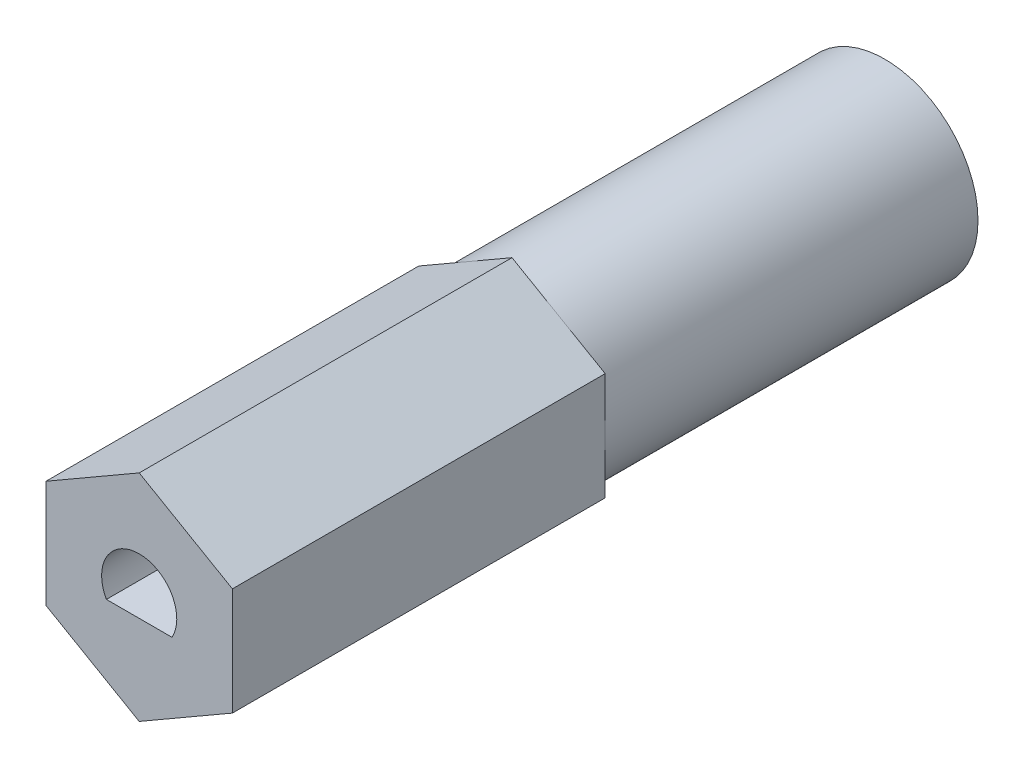
ISO-10303-21;
HEADER;
FILE_DESCRIPTION(('STEP AP214'),'2;1');
FILE_NAME('part.step','',(''),(''),'','','');
FILE_SCHEMA(('AUTOMOTIVE_DESIGN { 1 0 10303 214 1 1 1 1 }'));
ENDSEC;
DATA;
#1=APPLICATION_CONTEXT('core data for automotive mechanical design processes');
#2=APPLICATION_PROTOCOL_DEFINITION('international standard','automotive_design',2000,#1);
#3=PRODUCT_CONTEXT('',#1,'mechanical');
#4=PRODUCT('Part','Part','',(#3));
#5=PRODUCT_RELATED_PRODUCT_CATEGORY('part','',(#4));
#6=PRODUCT_DEFINITION_FORMATION('','',#4);
#7=PRODUCT_DEFINITION_CONTEXT('part definition',#1,'design');
#8=PRODUCT_DEFINITION('design','',#6,#7);
#9=PRODUCT_DEFINITION_SHAPE('','',#8);
#10=(LENGTH_UNIT() NAMED_UNIT(*) SI_UNIT(.MILLI.,.METRE.));
#11=(NAMED_UNIT(*) PLANE_ANGLE_UNIT() SI_UNIT($,.RADIAN.));
#12=(NAMED_UNIT(*) SI_UNIT($,.STERADIAN.) SOLID_ANGLE_UNIT());
#13=UNCERTAINTY_MEASURE_WITH_UNIT(LENGTH_MEASURE(1.E-05),#10,'distance_accuracy_value','');
#14=(GEOMETRIC_REPRESENTATION_CONTEXT(3) GLOBAL_UNCERTAINTY_ASSIGNED_CONTEXT((#13)) GLOBAL_UNIT_ASSIGNED_CONTEXT((#10,
#11,#12)) REPRESENTATION_CONTEXT('',''));
#15=CARTESIAN_POINT('',(0.,0.,0.));
#16=DIRECTION('',(0.,0.,1.));
#17=DIRECTION('',(1.,0.,0.));
#18=AXIS2_PLACEMENT_3D('',#15,#16,#17);
#19=CARTESIAN_POINT('',(3.175,1.83308710467706,-25.4));
#20=DIRECTION('',(0.5,0.866025403784439,0.));
#21=DIRECTION('',(-0.866025403784439,0.5,0.));
#22=AXIS2_PLACEMENT_3D('',#19,#20,#21);
#23=PLANE('',#22);
#24=DIRECTION('',(0.866025403784439,-0.5,0.));
#25=VECTOR('',#24,1.);
#26=CARTESIAN_POINT('',(3.175,1.83308710467706,-12.7));
#27=LINE('',#26,#25);
#28=CARTESIAN_POINT('',(0.,3.66617420935412,-12.7));
#29=VERTEX_POINT('',#28);
#30=CARTESIAN_POINT('',(1.5875,2.74963065701559,-12.7));
#31=VERTEX_POINT('',#30);
#32=EDGE_CURVE('E153',#29,#31,#27,.T.);
#33=ORIENTED_EDGE('',*,*,#32,.F.);
#34=DIRECTION('',(0.,0.,1.));
#35=VECTOR('',#34,1.);
#36=CARTESIAN_POINT('',(0.,3.66617420935412,-25.4));
#37=LINE('',#36,#35);
#38=CARTESIAN_POINT('',(0.,3.66617420935412,0.));
#39=VERTEX_POINT('',#38);
#40=EDGE_CURVE('E186',#29,#39,#37,.T.);
#41=ORIENTED_EDGE('',*,*,#40,.T.);
#42=DIRECTION('',(-0.866025403784439,0.5,0.));
#43=VECTOR('',#42,1.);
#44=CARTESIAN_POINT('',(3.175,1.83308710467706,0.));
#45=LINE('',#44,#43);
#46=CARTESIAN_POINT('',(3.175,1.83308710467706,0.));
#47=VERTEX_POINT('',#46);
#48=EDGE_CURVE('E167',#47,#39,#45,.T.);
#49=ORIENTED_EDGE('',*,*,#48,.F.);
#50=DIRECTION('',(0.,0.,1.));
#51=VECTOR('',#50,1.);
#52=CARTESIAN_POINT('',(3.175,1.83308710467706,-25.4));
#53=LINE('',#52,#51);
#54=CARTESIAN_POINT('',(3.175,1.83308710467706,-12.7));
#55=VERTEX_POINT('',#54);
#56=EDGE_CURVE('E187',#55,#47,#53,.T.);
#57=ORIENTED_EDGE('',*,*,#56,.F.);
#58=EDGE_CURVE('E124',#31,#55,#27,.T.);
#59=ORIENTED_EDGE('',*,*,#58,.F.);
#60=EDGE_LOOP('',(#33,#41,#49,#57,#59));
#61=FACE_BOUND('',#60,.T.);
#62=ADVANCED_FACE('F36',(#61),#23,.T.);
#63=CARTESIAN_POINT('',(3.175,-1.83308710467706,-25.4));
#64=DIRECTION('',(1.,0.,0.));
#65=DIRECTION('',(0.,1.,0.));
#66=AXIS2_PLACEMENT_3D('',#63,#64,#65);
#67=PLANE('',#66);
#68=DIRECTION('',(0.,-1.,0.));
#69=VECTOR('',#68,1.);
#70=CARTESIAN_POINT('',(3.175,-1.83308710467706,-12.7));
#71=LINE('',#70,#69);
#72=CARTESIAN_POINT('',(3.175,0.,-12.7));
#73=VERTEX_POINT('',#72);
#74=EDGE_CURVE('E118',#55,#73,#71,.T.);
#75=ORIENTED_EDGE('',*,*,#74,.F.);
#76=ORIENTED_EDGE('',*,*,#56,.T.);
#77=DIRECTION('',(0.,1.,0.));
#78=VECTOR('',#77,1.);
#79=CARTESIAN_POINT('',(3.175,-1.83308710467706,0.));
#80=LINE('',#79,#78);
#81=CARTESIAN_POINT('',(3.175,-1.83308710467706,0.));
#82=VERTEX_POINT('',#81);
#83=EDGE_CURVE('E183',#82,#47,#80,.T.);
#84=ORIENTED_EDGE('',*,*,#83,.F.);
#85=DIRECTION('',(0.,0.,1.));
#86=VECTOR('',#85,1.);
#87=CARTESIAN_POINT('',(3.175,-1.83308710467706,-25.4));
#88=LINE('',#87,#86);
#89=CARTESIAN_POINT('',(3.175,-1.83308710467706,-12.7));
#90=VERTEX_POINT('',#89);
#91=EDGE_CURVE('E147',#90,#82,#88,.T.);
#92=ORIENTED_EDGE('',*,*,#91,.F.);
#93=EDGE_CURVE('E128',#73,#90,#71,.T.);
#94=ORIENTED_EDGE('',*,*,#93,.F.);
#95=EDGE_LOOP('',(#75,#76,#84,#92,#94));
#96=FACE_BOUND('',#95,.T.);
#97=ADVANCED_FACE('F145',(#96),#67,.T.);
#98=CARTESIAN_POINT('',(0.,-3.66617420935412,-25.4));
#99=DIRECTION('',(0.5,-0.866025403784438,0.));
#100=DIRECTION('',(0.866025403784439,0.5,0.));
#101=AXIS2_PLACEMENT_3D('',#98,#99,#100);
#102=PLANE('',#101);
#103=DIRECTION('',(-0.866025403784439,-0.5,0.));
#104=VECTOR('',#103,1.);
#105=CARTESIAN_POINT('',(0.,-3.66617420935412,-12.7));
#106=LINE('',#105,#104);
#107=CARTESIAN_POINT('',(1.5875,-2.74963065701559,-12.7));
#108=VERTEX_POINT('',#107);
#109=EDGE_CURVE('E135',#90,#108,#106,.T.);
#110=ORIENTED_EDGE('',*,*,#109,.F.);
#111=ORIENTED_EDGE('',*,*,#91,.T.);
#112=DIRECTION('',(0.866025403784439,0.5,0.));
#113=VECTOR('',#112,1.);
#114=CARTESIAN_POINT('',(0.,-3.66617420935412,0.));
#115=LINE('',#114,#113);
#116=CARTESIAN_POINT('',(0.,-3.66617420935412,0.));
#117=VERTEX_POINT('',#116);
#118=EDGE_CURVE('E180',#117,#82,#115,.T.);
#119=ORIENTED_EDGE('',*,*,#118,.F.);
#120=DIRECTION('',(0.,0.,1.));
#121=VECTOR('',#120,1.);
#122=CARTESIAN_POINT('',(0.,-3.66617420935412,-25.4));
#123=LINE('',#122,#121);
#124=CARTESIAN_POINT('',(0.,-3.66617420935412,-12.7));
#125=VERTEX_POINT('',#124);
#126=EDGE_CURVE('E191',#125,#117,#123,.T.);
#127=ORIENTED_EDGE('',*,*,#126,.F.);
#128=EDGE_CURVE('E148',#108,#125,#106,.T.);
#129=ORIENTED_EDGE('',*,*,#128,.F.);
#130=EDGE_LOOP('',(#110,#111,#119,#127,#129));
#131=FACE_BOUND('',#130,.T.);
#132=ADVANCED_FACE('F217',(#131),#102,.T.);
#133=CARTESIAN_POINT('',(-3.175,-1.83308710467706,-25.4));
#134=DIRECTION('',(-0.5,-0.866025403784439,0.));
#135=DIRECTION('',(0.866025403784439,-0.5,0.));
#136=AXIS2_PLACEMENT_3D('',#133,#134,#135);
#137=PLANE('',#136);
#138=DIRECTION('',(-0.866025403784439,0.5,0.));
#139=VECTOR('',#138,1.);
#140=CARTESIAN_POINT('',(-3.175,-1.83308710467706,-12.7));
#141=LINE('',#140,#139);
#142=CARTESIAN_POINT('',(-1.5875,-2.74963065701559,-12.7));
#143=VERTEX_POINT('',#142);
#144=EDGE_CURVE('E221',#125,#143,#141,.T.);
#145=ORIENTED_EDGE('',*,*,#144,.F.);
#146=ORIENTED_EDGE('',*,*,#126,.T.);
#147=DIRECTION('',(0.866025403784439,-0.5,0.));
#148=VECTOR('',#147,1.);
#149=CARTESIAN_POINT('',(-3.175,-1.83308710467706,0.));
#150=LINE('',#149,#148);
#151=CARTESIAN_POINT('',(-3.175,-1.83308710467706,0.));
#152=VERTEX_POINT('',#151);
#153=EDGE_CURVE('E177',#152,#117,#150,.T.);
#154=ORIENTED_EDGE('',*,*,#153,.F.);
#155=DIRECTION('',(0.,0.,1.));
#156=VECTOR('',#155,1.);
#157=CARTESIAN_POINT('',(-3.175,-1.83308710467706,-25.4));
#158=LINE('',#157,#156);
#159=CARTESIAN_POINT('',(-3.175,-1.83308710467706,-12.7));
#160=VERTEX_POINT('',#159);
#161=EDGE_CURVE('E193',#160,#152,#158,.T.);
#162=ORIENTED_EDGE('',*,*,#161,.F.);
#163=EDGE_CURVE('E222',#143,#160,#141,.T.);
#164=ORIENTED_EDGE('',*,*,#163,.F.);
#165=EDGE_LOOP('',(#145,#146,#154,#162,#164));
#166=FACE_BOUND('',#165,.T.);
#167=ADVANCED_FACE('F241',(#166),#137,.T.);
#168=CARTESIAN_POINT('',(-3.175,1.83308710467706,-25.4));
#169=DIRECTION('',(-1.,0.,0.));
#170=DIRECTION('',(0.,-1.,0.));
#171=AXIS2_PLACEMENT_3D('',#168,#169,#170);
#172=PLANE('',#171);
#173=DIRECTION('',(0.,1.,0.));
#174=VECTOR('',#173,1.);
#175=CARTESIAN_POINT('',(-3.175,1.83308710467706,-12.7));
#176=LINE('',#175,#174);
#177=CARTESIAN_POINT('',(-3.175,0.,-12.7));
#178=VERTEX_POINT('',#177);
#179=EDGE_CURVE('E223',#160,#178,#176,.T.);
#180=ORIENTED_EDGE('',*,*,#179,.F.);
#181=ORIENTED_EDGE('',*,*,#161,.T.);
#182=DIRECTION('',(0.,-1.,0.));
#183=VECTOR('',#182,1.);
#184=CARTESIAN_POINT('',(-3.175,1.83308710467706,0.));
#185=LINE('',#184,#183);
#186=CARTESIAN_POINT('',(-3.175,1.83308710467706,0.));
#187=VERTEX_POINT('',#186);
#188=EDGE_CURVE('E174',#187,#152,#185,.T.);
#189=ORIENTED_EDGE('',*,*,#188,.F.);
#190=DIRECTION('',(0.,0.,1.));
#191=VECTOR('',#190,1.);
#192=CARTESIAN_POINT('',(-3.175,1.83308710467706,-25.4));
#193=LINE('',#192,#191);
#194=CARTESIAN_POINT('',(-3.175,1.83308710467706,-12.7));
#195=VERTEX_POINT('',#194);
#196=EDGE_CURVE('E195',#195,#187,#193,.T.);
#197=ORIENTED_EDGE('',*,*,#196,.F.);
#198=EDGE_CURVE('E143',#178,#195,#176,.T.);
#199=ORIENTED_EDGE('',*,*,#198,.F.);
#200=EDGE_LOOP('',(#180,#181,#189,#197,#199));
#201=FACE_BOUND('',#200,.T.);
#202=ADVANCED_FACE('F239',(#201),#172,.T.);
#203=CARTESIAN_POINT('',(0.,3.66617420935412,-25.4));
#204=DIRECTION('',(-0.5,0.866025403784439,0.));
#205=DIRECTION('',(-0.866025403784439,-0.5,0.));
#206=AXIS2_PLACEMENT_3D('',#203,#204,#205);
#207=PLANE('',#206);
#208=DIRECTION('',(0.866025403784439,0.5,0.));
#209=VECTOR('',#208,1.);
#210=CARTESIAN_POINT('',(0.,3.66617420935412,-12.7));
#211=LINE('',#210,#209);
#212=CARTESIAN_POINT('',(-1.5875,2.74963065701559,-12.7));
#213=VERTEX_POINT('',#212);
#214=EDGE_CURVE('E12',#195,#213,#211,.T.);
#215=ORIENTED_EDGE('',*,*,#214,.F.);
#216=ORIENTED_EDGE('',*,*,#196,.T.);
#217=DIRECTION('',(-0.866025403784439,-0.5,0.));
#218=VECTOR('',#217,1.);
#219=CARTESIAN_POINT('',(0.,3.66617420935412,0.));
#220=LINE('',#219,#218);
#221=EDGE_CURVE('E171',#39,#187,#220,.T.);
#222=ORIENTED_EDGE('',*,*,#221,.F.);
#223=ORIENTED_EDGE('',*,*,#40,.F.);
#224=EDGE_CURVE('E39',#213,#29,#211,.T.);
#225=ORIENTED_EDGE('',*,*,#224,.F.);
#226=EDGE_LOOP('',(#215,#216,#222,#223,#225));
#227=FACE_BOUND('',#226,.T.);
#228=ADVANCED_FACE('F208',(#227),#207,.T.);
#229=CARTESIAN_POINT('',(0.,0.,0.));
#230=DIRECTION('',(0.,0.,1.));
#231=DIRECTION('',(1.,0.,0.));
#232=AXIS2_PLACEMENT_3D('',#229,#230,#231);
#233=PLANE('',#232);
#234=CARTESIAN_POINT('',(0.,0.,0.));
#235=DIRECTION('',(0.,0.,1.));
#236=DIRECTION('',(1.,0.,0.));
#237=AXIS2_PLACEMENT_3D('',#234,#235,#236);
#238=CIRCLE('',#237,1.28016);
#239=CARTESIAN_POINT('',(1.11731132635448,-0.62484,0.));
#240=VERTEX_POINT('',#239);
#241=CARTESIAN_POINT('',(-1.11731132635448,-0.62484,0.));
#242=VERTEX_POINT('',#241);
#243=EDGE_CURVE('E58',#240,#242,#238,.T.);
#244=ORIENTED_EDGE('',*,*,#243,.F.);
#245=DIRECTION('',(1.,0.,0.));
#246=VECTOR('',#245,1.);
#247=CARTESIAN_POINT('',(-1.11731132635448,-0.62484,0.));
#248=LINE('',#247,#246);
#249=EDGE_CURVE('E158',#242,#240,#248,.T.);
#250=ORIENTED_EDGE('',*,*,#249,.F.);
#251=EDGE_LOOP('',(#244,#250));
#252=FACE_BOUND('',#251,.T.);
#253=ORIENTED_EDGE('',*,*,#48,.T.);
#254=ORIENTED_EDGE('',*,*,#221,.T.);
#255=ORIENTED_EDGE('',*,*,#188,.T.);
#256=ORIENTED_EDGE('',*,*,#153,.T.);
#257=ORIENTED_EDGE('',*,*,#118,.T.);
#258=ORIENTED_EDGE('',*,*,#83,.T.);
#259=EDGE_LOOP('',(#253,#254,#255,#256,#257,#258));
#260=FACE_BOUND('',#259,.T.);
#261=ADVANCED_FACE('F212',(#252,#260),#233,.T.);
#262=CARTESIAN_POINT('',(0.,0.,-5.08));
#263=DIRECTION('',(0.,0.,1.));
#264=DIRECTION('',(1.,0.,0.));
#265=AXIS2_PLACEMENT_3D('',#262,#263,#264);
#266=CYLINDRICAL_SURFACE('',#265,1.28016);
#267=ORIENTED_EDGE('',*,*,#243,.T.);
#268=DIRECTION('',(0.,0.,1.));
#269=VECTOR('',#268,1.);
#270=CARTESIAN_POINT('',(-1.11731132635448,-0.62484,-5.08));
#271=LINE('',#270,#269);
#272=CARTESIAN_POINT('',(-1.11731132635448,-0.62484,-5.08));
#273=VERTEX_POINT('',#272);
#274=EDGE_CURVE('E161',#273,#242,#271,.T.);
#275=ORIENTED_EDGE('',*,*,#274,.F.);
#276=CARTESIAN_POINT('',(0.,0.,-5.08));
#277=DIRECTION('',(0.,0.,1.));
#278=DIRECTION('',(1.,0.,0.));
#279=AXIS2_PLACEMENT_3D('',#276,#277,#278);
#280=CIRCLE('',#279,1.28016);
#281=CARTESIAN_POINT('',(1.11731132635448,-0.62484,-5.08));
#282=VERTEX_POINT('',#281);
#283=EDGE_CURVE('E154',#282,#273,#280,.T.);
#284=ORIENTED_EDGE('',*,*,#283,.F.);
#285=DIRECTION('',(0.,0.,1.));
#286=VECTOR('',#285,1.);
#287=CARTESIAN_POINT('',(1.11731132635448,-0.62484,-5.08));
#288=LINE('',#287,#286);
#289=EDGE_CURVE('E165',#282,#240,#288,.T.);
#290=ORIENTED_EDGE('',*,*,#289,.T.);
#291=EDGE_LOOP('',(#267,#275,#284,#290));
#292=FACE_BOUND('',#291,.T.);
#293=ADVANCED_FACE('F260',(#292),#266,.F.);
#294=CARTESIAN_POINT('',(-1.11731132635448,-0.62484,-5.08));
#295=DIRECTION('',(0.,-1.,0.));
#296=DIRECTION('',(0.,0.,-1.));
#297=AXIS2_PLACEMENT_3D('',#294,#295,#296);
#298=PLANE('',#297);
#299=ORIENTED_EDGE('',*,*,#249,.T.);
#300=ORIENTED_EDGE('',*,*,#289,.F.);
#301=DIRECTION('',(1.,0.,0.));
#302=VECTOR('',#301,1.);
#303=CARTESIAN_POINT('',(-1.11731132635448,-0.62484,-5.08));
#304=LINE('',#303,#302);
#305=EDGE_CURVE('E157',#273,#282,#304,.T.);
#306=ORIENTED_EDGE('',*,*,#305,.F.);
#307=ORIENTED_EDGE('',*,*,#274,.T.);
#308=EDGE_LOOP('',(#299,#300,#306,#307));
#309=FACE_BOUND('',#308,.T.);
#310=ADVANCED_FACE('F268',(#309),#298,.F.);
#311=CARTESIAN_POINT('',(0.,0.,-5.08));
#312=DIRECTION('',(0.,0.,1.));
#313=DIRECTION('',(1.,0.,0.));
#314=AXIS2_PLACEMENT_3D('',#311,#312,#313);
#315=PLANE('',#314);
#316=ORIENTED_EDGE('',*,*,#283,.T.);
#317=ORIENTED_EDGE('',*,*,#305,.T.);
#318=EDGE_LOOP('',(#316,#317));
#319=FACE_BOUND('',#318,.T.);
#320=ADVANCED_FACE('F271',(#319),#315,.T.);
#321=CARTESIAN_POINT('',(0.,0.,-12.7));
#322=DIRECTION('',(0.,0.,1.));
#323=DIRECTION('',(1.,0.,0.));
#324=AXIS2_PLACEMENT_3D('',#321,#322,#323);
#325=PLANE('',#324);
#326=ORIENTED_EDGE('',*,*,#32,.T.);
#327=CARTESIAN_POINT('',(0.,0.,-12.7));
#328=DIRECTION('',(0.,0.,1.));
#329=DIRECTION('',(1.,0.,0.));
#330=AXIS2_PLACEMENT_3D('',#327,#328,#329);
#331=CIRCLE('',#330,3.175);
#332=EDGE_CURVE('E50',#31,#213,#331,.T.);
#333=ORIENTED_EDGE('',*,*,#332,.T.);
#334=ORIENTED_EDGE('',*,*,#224,.T.);
#335=EDGE_LOOP('',(#326,#333,#334));
#336=FACE_BOUND('',#335,.T.);
#337=ADVANCED_FACE('F201',(#336),#325,.F.);
#338=ORIENTED_EDGE('',*,*,#58,.T.);
#339=ORIENTED_EDGE('',*,*,#74,.T.);
#340=EDGE_CURVE('E122',#73,#31,#331,.T.);
#341=ORIENTED_EDGE('',*,*,#340,.T.);
#342=EDGE_LOOP('',(#338,#339,#341));
#343=FACE_BOUND('',#342,.T.);
#344=ADVANCED_FACE('F120',(#343),#325,.F.);
#345=ORIENTED_EDGE('',*,*,#93,.T.);
#346=ORIENTED_EDGE('',*,*,#109,.T.);
#347=EDGE_CURVE('E132',#108,#73,#331,.T.);
#348=ORIENTED_EDGE('',*,*,#347,.T.);
#349=EDGE_LOOP('',(#345,#346,#348));
#350=FACE_BOUND('',#349,.T.);
#351=ADVANCED_FACE('F133',(#350),#325,.F.);
#352=ORIENTED_EDGE('',*,*,#128,.T.);
#353=ORIENTED_EDGE('',*,*,#144,.T.);
#354=EDGE_CURVE('E139',#143,#108,#331,.T.);
#355=ORIENTED_EDGE('',*,*,#354,.T.);
#356=EDGE_LOOP('',(#352,#353,#355));
#357=FACE_BOUND('',#356,.T.);
#358=ADVANCED_FACE('F282',(#357),#325,.F.);
#359=ORIENTED_EDGE('',*,*,#163,.T.);
#360=ORIENTED_EDGE('',*,*,#179,.T.);
#361=EDGE_CURVE('E233',#178,#143,#331,.T.);
#362=ORIENTED_EDGE('',*,*,#361,.T.);
#363=EDGE_LOOP('',(#359,#360,#362));
#364=FACE_BOUND('',#363,.T.);
#365=ADVANCED_FACE('F232',(#364),#325,.F.);
#366=CARTESIAN_POINT('',(0.,0.,-25.4));
#367=DIRECTION('',(0.,0.,1.));
#368=DIRECTION('',(1.,0.,0.));
#369=AXIS2_PLACEMENT_3D('',#366,#367,#368);
#370=CYLINDRICAL_SURFACE('',#369,3.175);
#371=ORIENTED_EDGE('',*,*,#332,.F.);
#372=ORIENTED_EDGE('',*,*,#340,.F.);
#373=ORIENTED_EDGE('',*,*,#347,.F.);
#374=ORIENTED_EDGE('',*,*,#354,.F.);
#375=ORIENTED_EDGE('',*,*,#361,.F.);
#376=EDGE_CURVE('E237',#213,#178,#331,.T.);
#377=ORIENTED_EDGE('',*,*,#376,.F.);
#378=EDGE_LOOP('',(#371,#372,#373,#374,#375,#377));
#379=FACE_BOUND('',#378,.T.);
#380=CARTESIAN_POINT('',(0.,0.,-25.4));
#381=DIRECTION('',(0.,0.,1.));
#382=DIRECTION('',(1.,0.,0.));
#383=AXIS2_PLACEMENT_3D('',#380,#381,#382);
#384=CIRCLE('',#383,3.175);
#385=CARTESIAN_POINT('',(3.175,0.,-25.4));
#386=VERTEX_POINT('',#385);
#387=EDGE_CURVE('E189',#386,#386,#384,.T.);
#388=ORIENTED_EDGE('',*,*,#387,.T.);
#389=EDGE_LOOP('',(#388));
#390=FACE_BOUND('',#389,.T.);
#391=ADVANCED_FACE('F141',(#379,#390),#370,.T.);
#392=ORIENTED_EDGE('',*,*,#198,.T.);
#393=ORIENTED_EDGE('',*,*,#214,.T.);
#394=ORIENTED_EDGE('',*,*,#376,.T.);
#395=EDGE_LOOP('',(#392,#393,#394));
#396=FACE_BOUND('',#395,.T.);
#397=ADVANCED_FACE('F238',(#396),#325,.F.);
#398=CARTESIAN_POINT('',(0.,0.,-25.4));
#399=DIRECTION('',(0.,0.,1.));
#400=DIRECTION('',(1.,0.,0.));
#401=AXIS2_PLACEMENT_3D('',#398,#399,#400);
#402=PLANE('',#401);
#403=ORIENTED_EDGE('',*,*,#387,.F.);
#404=EDGE_LOOP('',(#403));
#405=FACE_BOUND('',#404,.T.);
#406=ADVANCED_FACE('F262',(#405),#402,.F.);
#407=CLOSED_SHELL('',(#62,#97,#132,#167,#202,#228,#261,#293,#310,#320,#337,#344,#351,#358,#365,
#391,#397,#406));
#408=MANIFOLD_SOLID_BREP('B2',#407);
#409=ADVANCED_BREP_SHAPE_REPRESENTATION('',(#18,#408),#14);
#410=SHAPE_DEFINITION_REPRESENTATION(#9,#409);
ENDSEC;
END-ISO-10303-21;
